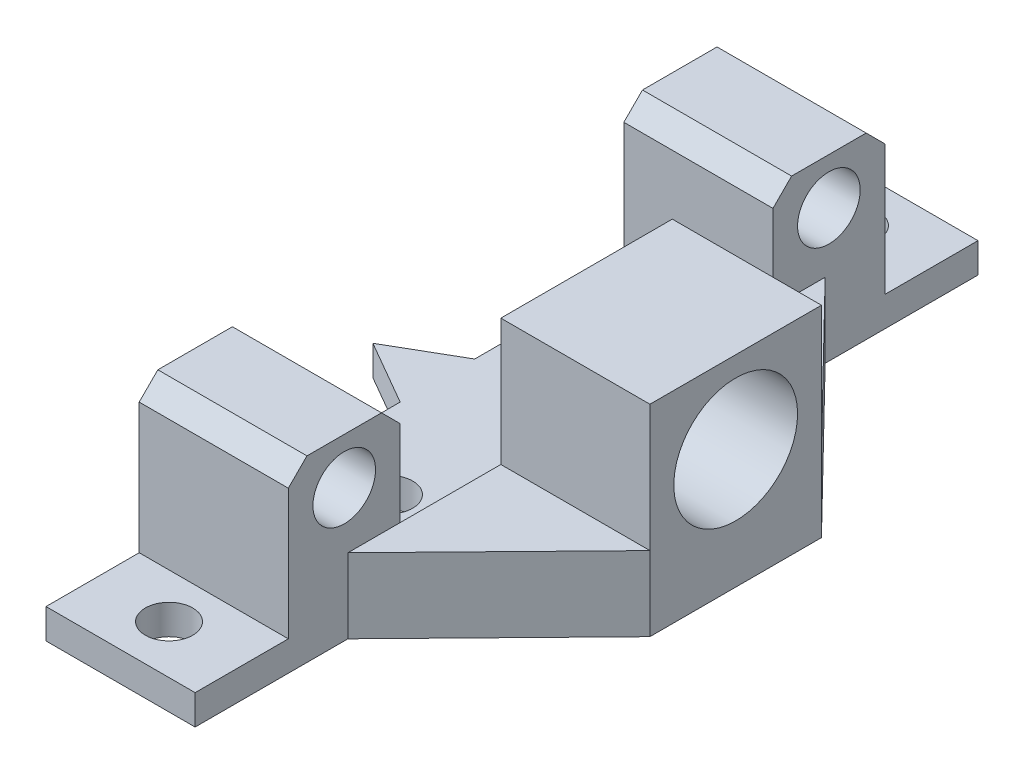
ISO-10303-21;
HEADER;
FILE_DESCRIPTION(('STEP AP214'),'2;1');
FILE_NAME('part.step','',(''),(''),'','','');
FILE_SCHEMA(('AUTOMOTIVE_DESIGN { 1 0 10303 214 1 1 1 1 }'));
ENDSEC;
DATA;
#1=APPLICATION_CONTEXT('core data for automotive mechanical design processes');
#2=APPLICATION_PROTOCOL_DEFINITION('international standard','automotive_design',2000,#1);
#3=PRODUCT_CONTEXT('',#1,'mechanical');
#4=PRODUCT('Part','Part','',(#3));
#5=PRODUCT_RELATED_PRODUCT_CATEGORY('part','',(#4));
#6=PRODUCT_DEFINITION_FORMATION('','',#4);
#7=PRODUCT_DEFINITION_CONTEXT('part definition',#1,'design');
#8=PRODUCT_DEFINITION('design','',#6,#7);
#9=PRODUCT_DEFINITION_SHAPE('','',#8);
#10=(LENGTH_UNIT() NAMED_UNIT(*) SI_UNIT(.MILLI.,.METRE.));
#11=(NAMED_UNIT(*) PLANE_ANGLE_UNIT() SI_UNIT($,.RADIAN.));
#12=(NAMED_UNIT(*) SI_UNIT($,.STERADIAN.) SOLID_ANGLE_UNIT());
#13=UNCERTAINTY_MEASURE_WITH_UNIT(LENGTH_MEASURE(1.E-05),#10,'distance_accuracy_value','');
#14=(GEOMETRIC_REPRESENTATION_CONTEXT(3) GLOBAL_UNCERTAINTY_ASSIGNED_CONTEXT((#13)) GLOBAL_UNIT_ASSIGNED_CONTEXT((#10,
#11,#12)) REPRESENTATION_CONTEXT('',''));
#15=CARTESIAN_POINT('',(0.,0.,0.));
#16=DIRECTION('',(0.,0.,1.));
#17=DIRECTION('',(1.,0.,0.));
#18=AXIS2_PLACEMENT_3D('',#15,#16,#17);
#19=CARTESIAN_POINT('',(40.,0.,-64.));
#20=DIRECTION('',(0.,0.,1.));
#21=DIRECTION('',(1.,0.,0.));
#22=AXIS2_PLACEMENT_3D('',#19,#20,#21);
#23=PLANE('',#22);
#24=DIRECTION('',(-1.,0.,0.));
#25=VECTOR('',#24,1.);
#26=CARTESIAN_POINT('',(40.,10.,-64.));
#27=LINE('',#26,#25);
#28=CARTESIAN_POINT('',(40.,10.,-64.));
#29=VERTEX_POINT('',#28);
#30=CARTESIAN_POINT('',(20.,10.,-64.));
#31=VERTEX_POINT('',#30);
#32=EDGE_CURVE('E250',#29,#31,#27,.T.);
#33=ORIENTED_EDGE('',*,*,#32,.T.);
#34=DIRECTION('',(0.,1.,0.));
#35=VECTOR('',#34,1.);
#36=CARTESIAN_POINT('',(20.,0.,-64.));
#37=LINE('',#36,#35);
#38=CARTESIAN_POINT('',(20.,27.,-64.));
#39=VERTEX_POINT('',#38);
#40=EDGE_CURVE('E289',#31,#39,#37,.T.);
#41=ORIENTED_EDGE('',*,*,#40,.T.);
#42=DIRECTION('',(-1.,0.,0.));
#43=VECTOR('',#42,1.);
#44=CARTESIAN_POINT('',(40.,27.,-64.));
#45=LINE('',#44,#43);
#46=CARTESIAN_POINT('',(40.,27.,-64.));
#47=VERTEX_POINT('',#46);
#48=EDGE_CURVE('E294',#47,#39,#45,.T.);
#49=ORIENTED_EDGE('',*,*,#48,.F.);
#50=DIRECTION('',(0.,1.,0.));
#51=VECTOR('',#50,1.);
#52=CARTESIAN_POINT('',(40.,0.,-64.));
#53=LINE('',#52,#51);
#54=EDGE_CURVE('E280',#29,#47,#53,.T.);
#55=ORIENTED_EDGE('',*,*,#54,.F.);
#56=EDGE_LOOP('',(#33,#41,#49,#55));
#57=FACE_BOUND('',#56,.T.);
#58=ADVANCED_FACE('F36',(#57),#23,.F.);
#59=CARTESIAN_POINT('',(20.,4.,0.));
#60=DIRECTION('',(-1.,0.,0.));
#61=DIRECTION('',(0.,0.,1.));
#62=AXIS2_PLACEMENT_3D('',#59,#60,#61);
#63=PLANE('',#62);
#64=CARTESIAN_POINT('',(20.,17.8,-20.));
#65=DIRECTION('',(-1.,0.,0.));
#66=DIRECTION('',(0.,0.,1.));
#67=AXIS2_PLACEMENT_3D('',#64,#65,#66);
#68=CIRCLE('',#67,4.2);
#69=CARTESIAN_POINT('',(20.,17.8,-15.8));
#70=VERTEX_POINT('',#69);
#71=EDGE_CURVE('E391',#70,#70,#68,.T.);
#72=ORIENTED_EDGE('',*,*,#71,.T.);
#73=EDGE_LOOP('',(#72));
#74=FACE_BOUND('',#73,.T.);
#75=DIRECTION('',(0.,0.,-1.));
#76=VECTOR('',#75,1.);
#77=CARTESIAN_POINT('',(20.,0.,0.));
#78=LINE('',#77,#76);
#79=CARTESIAN_POINT('',(20.,0.,0.));
#80=VERTEX_POINT('',#79);
#81=CARTESIAN_POINT('',(20.,0.,-20.5));
#82=VERTEX_POINT('',#81);
#83=EDGE_CURVE('E240',#80,#82,#78,.T.);
#84=ORIENTED_EDGE('',*,*,#83,.T.);
#85=DIRECTION('',(0.,-1.,0.));
#86=VECTOR('',#85,1.);
#87=CARTESIAN_POINT('',(20.,10.,-20.5));
#88=LINE('',#87,#86);
#89=CARTESIAN_POINT('',(20.,10.,-20.5));
#90=VERTEX_POINT('',#89);
#91=EDGE_CURVE('E230',#90,#82,#88,.T.);
#92=ORIENTED_EDGE('',*,*,#91,.F.);
#93=DIRECTION('',(0.,0.,-1.));
#94=VECTOR('',#93,1.);
#95=CARTESIAN_POINT('',(20.,10.,-41.));
#96=LINE('',#95,#94);
#97=CARTESIAN_POINT('',(20.,10.,-27.5));
#98=VERTEX_POINT('',#97);
#99=EDGE_CURVE('E216',#90,#98,#96,.T.);
#100=ORIENTED_EDGE('',*,*,#99,.T.);
#101=DIRECTION('',(0.,-1.,0.));
#102=VECTOR('',#101,1.);
#103=CARTESIAN_POINT('',(20.,0.,-27.5));
#104=LINE('',#103,#102);
#105=CARTESIAN_POINT('',(20.,21.5,-27.5));
#106=VERTEX_POINT('',#105);
#107=EDGE_CURVE('E412',#106,#98,#104,.T.);
#108=ORIENTED_EDGE('',*,*,#107,.F.);
#109=DIRECTION('',(0.,0.707106781186543,0.707106781186552));
#110=VECTOR('',#109,1.);
#111=CARTESIAN_POINT('',(20.,24.5000000000001,-24.4999999999998));
#112=LINE('',#111,#110);
#113=CARTESIAN_POINT('',(20.,24.,-25.));
#114=VERTEX_POINT('',#113);
#115=EDGE_CURVE('E422',#106,#114,#112,.T.);
#116=ORIENTED_EDGE('',*,*,#115,.T.);
#117=DIRECTION('',(0.,0.,1.));
#118=VECTOR('',#117,1.);
#119=CARTESIAN_POINT('',(20.,24.,0.));
#120=LINE('',#119,#118);
#121=CARTESIAN_POINT('',(20.,24.,-15.));
#122=VERTEX_POINT('',#121);
#123=EDGE_CURVE('E424',#114,#122,#120,.T.);
#124=ORIENTED_EDGE('',*,*,#123,.T.);
#125=DIRECTION('',(0.,-0.707106781186545,0.70710678118655));
#126=VECTOR('',#125,1.);
#127=CARTESIAN_POINT('',(20.,4.50000000000009,4.50000000000005));
#128=LINE('',#127,#126);
#129=CARTESIAN_POINT('',(20.,21.5,-12.5));
#130=VERTEX_POINT('',#129);
#131=EDGE_CURVE('E426',#122,#130,#128,.T.);
#132=ORIENTED_EDGE('',*,*,#131,.T.);
#133=DIRECTION('',(0.,-1.,0.));
#134=VECTOR('',#133,1.);
#135=CARTESIAN_POINT('',(20.,0.,-12.5));
#136=LINE('',#135,#134);
#137=CARTESIAN_POINT('',(20.,4.,-12.5));
#138=VERTEX_POINT('',#137);
#139=EDGE_CURVE('E428',#130,#138,#136,.T.);
#140=ORIENTED_EDGE('',*,*,#139,.T.);
#141=DIRECTION('',(0.,0.,-1.));
#142=VECTOR('',#141,1.);
#143=CARTESIAN_POINT('',(20.,4.,0.));
#144=LINE('',#143,#142);
#145=CARTESIAN_POINT('',(20.,4.,0.));
#146=VERTEX_POINT('',#145);
#147=EDGE_CURVE('E440',#146,#138,#144,.T.);
#148=ORIENTED_EDGE('',*,*,#147,.F.);
#149=DIRECTION('',(0.,-1.,0.));
#150=VECTOR('',#149,1.);
#151=CARTESIAN_POINT('',(20.,4.,0.));
#152=LINE('',#151,#150);
#153=EDGE_CURVE('E44',#146,#80,#152,.T.);
#154=ORIENTED_EDGE('',*,*,#153,.T.);
#155=EDGE_LOOP('',(#84,#92,#100,#108,#116,#124,#132,#140,#148,#154));
#156=FACE_BOUND('',#155,.T.);
#157=ADVANCED_FACE('F237',(#74,#156),#63,.F.);
#158=CARTESIAN_POINT('',(20.,17.8,-85.));
#159=DIRECTION('',(-1.,0.,0.));
#160=DIRECTION('',(0.,0.,1.));
#161=AXIS2_PLACEMENT_3D('',#158,#159,#160);
#162=CIRCLE('',#161,4.19999999999999);
#163=CARTESIAN_POINT('',(20.,17.8,-80.8));
#164=VERTEX_POINT('',#163);
#165=EDGE_CURVE('E352',#164,#164,#162,.F.);
#166=ORIENTED_EDGE('',*,*,#165,.F.);
#167=EDGE_LOOP('',(#166));
#168=FACE_BOUND('',#167,.T.);
#169=DIRECTION('',(0.,0.,-1.));
#170=VECTOR('',#169,1.);
#171=CARTESIAN_POINT('',(20.,10.,-64.));
#172=LINE('',#171,#170);
#173=CARTESIAN_POINT('',(20.,10.,-77.5));
#174=VERTEX_POINT('',#173);
#175=CARTESIAN_POINT('',(20.,10.,-84.5));
#176=VERTEX_POINT('',#175);
#177=EDGE_CURVE('E253',#174,#176,#172,.T.);
#178=ORIENTED_EDGE('',*,*,#177,.T.);
#179=DIRECTION('',(0.,-1.,0.));
#180=VECTOR('',#179,1.);
#181=CARTESIAN_POINT('',(20.,10.,-84.5));
#182=LINE('',#181,#180);
#183=CARTESIAN_POINT('',(20.,0.,-84.5));
#184=VERTEX_POINT('',#183);
#185=EDGE_CURVE('E258',#176,#184,#182,.T.);
#186=ORIENTED_EDGE('',*,*,#185,.T.);
#187=CARTESIAN_POINT('',(20.,0.,-105.));
#188=VERTEX_POINT('',#187);
#189=EDGE_CURVE('E451',#184,#188,#78,.T.);
#190=ORIENTED_EDGE('',*,*,#189,.T.);
#191=DIRECTION('',(0.,-1.,0.));
#192=VECTOR('',#191,1.);
#193=CARTESIAN_POINT('',(20.,4.,-105.));
#194=LINE('',#193,#192);
#195=CARTESIAN_POINT('',(20.,4.,-105.));
#196=VERTEX_POINT('',#195);
#197=EDGE_CURVE('E457',#196,#188,#194,.T.);
#198=ORIENTED_EDGE('',*,*,#197,.F.);
#199=CARTESIAN_POINT('',(20.,4.,-92.5));
#200=VERTEX_POINT('',#199);
#201=EDGE_CURVE('E439',#200,#196,#144,.T.);
#202=ORIENTED_EDGE('',*,*,#201,.F.);
#203=DIRECTION('',(0.,-1.,0.));
#204=VECTOR('',#203,1.);
#205=CARTESIAN_POINT('',(20.,0.,-92.5));
#206=LINE('',#205,#204);
#207=CARTESIAN_POINT('',(20.,21.5,-92.5));
#208=VERTEX_POINT('',#207);
#209=EDGE_CURVE('E343',#208,#200,#206,.T.);
#210=ORIENTED_EDGE('',*,*,#209,.F.);
#211=DIRECTION('',(0.,-0.707106781186545,-0.70710678118655));
#212=VECTOR('',#211,1.);
#213=CARTESIAN_POINT('',(20.,57.0000000000001,-56.9999999999997));
#214=LINE('',#213,#212);
#215=CARTESIAN_POINT('',(20.,24.,-90.));
#216=VERTEX_POINT('',#215);
#217=EDGE_CURVE('E349',#216,#208,#214,.T.);
#218=ORIENTED_EDGE('',*,*,#217,.F.);
#219=DIRECTION('',(0.,0.,-1.));
#220=VECTOR('',#219,1.);
#221=CARTESIAN_POINT('',(20.,24.,0.));
#222=LINE('',#221,#220);
#223=CARTESIAN_POINT('',(20.,24.,-80.));
#224=VERTEX_POINT('',#223);
#225=EDGE_CURVE('E346',#224,#216,#222,.T.);
#226=ORIENTED_EDGE('',*,*,#225,.F.);
#227=DIRECTION('',(0.,0.707106781186543,-0.707106781186552));
#228=VECTOR('',#227,1.);
#229=CARTESIAN_POINT('',(20.,-27.9999999999999,-27.9999999999995));
#230=LINE('',#229,#228);
#231=CARTESIAN_POINT('',(20.,21.5,-77.5));
#232=VERTEX_POINT('',#231);
#233=EDGE_CURVE('E342',#232,#224,#230,.T.);
#234=ORIENTED_EDGE('',*,*,#233,.F.);
#235=DIRECTION('',(0.,-1.,0.));
#236=VECTOR('',#235,1.);
#237=CARTESIAN_POINT('',(20.,0.,-77.5));
#238=LINE('',#237,#236);
#239=EDGE_CURVE('E339',#232,#174,#238,.T.);
#240=ORIENTED_EDGE('',*,*,#239,.T.);
#241=EDGE_LOOP('',(#178,#186,#190,#198,#202,#210,#218,#226,#234,#240));
#242=FACE_BOUND('',#241,.T.);
#243=ADVANCED_FACE('F520',(#168,#242),#63,.F.);
#244=CARTESIAN_POINT('',(0.,4.,0.));
#245=DIRECTION('',(1.,0.,0.));
#246=DIRECTION('',(0.,0.,-1.));
#247=AXIS2_PLACEMENT_3D('',#244,#245,#246);
#248=PLANE('',#247);
#249=CARTESIAN_POINT('',(0.,17.8,-85.));
#250=DIRECTION('',(-1.,0.,0.));
#251=DIRECTION('',(0.,0.,1.));
#252=AXIS2_PLACEMENT_3D('',#249,#250,#251);
#253=CIRCLE('',#252,4.19999999999999);
#254=CARTESIAN_POINT('',(0.,17.8,-80.8));
#255=VERTEX_POINT('',#254);
#256=EDGE_CURVE('E338',#255,#255,#253,.T.);
#257=ORIENTED_EDGE('',*,*,#256,.F.);
#258=EDGE_LOOP('',(#257));
#259=FACE_BOUND('',#258,.T.);
#260=DIRECTION('',(0.,-1.,0.));
#261=VECTOR('',#260,1.);
#262=CARTESIAN_POINT('',(0.,17.228756555323,-57.5));
#263=LINE('',#262,#261);
#264=CARTESIAN_POINT('',(0.,4.,-57.5));
#265=VERTEX_POINT('',#264);
#266=CARTESIAN_POINT('',(0.,0.,-57.5));
#267=VERTEX_POINT('',#266);
#268=EDGE_CURVE('E325',#265,#267,#263,.T.);
#269=ORIENTED_EDGE('',*,*,#268,.F.);
#270=DIRECTION('',(0.,0.,1.));
#271=VECTOR('',#270,1.);
#272=CARTESIAN_POINT('',(0.,4.,0.));
#273=LINE('',#272,#271);
#274=CARTESIAN_POINT('',(0.,4.,-77.5));
#275=VERTEX_POINT('',#274);
#276=EDGE_CURVE('E436',#275,#265,#273,.T.);
#277=ORIENTED_EDGE('',*,*,#276,.F.);
#278=DIRECTION('',(0.,1.,0.));
#279=VECTOR('',#278,1.);
#280=CARTESIAN_POINT('',(0.,0.,-77.5));
#281=LINE('',#280,#279);
#282=CARTESIAN_POINT('',(0.,21.5,-77.5));
#283=VERTEX_POINT('',#282);
#284=EDGE_CURVE('E364',#275,#283,#281,.T.);
#285=ORIENTED_EDGE('',*,*,#284,.T.);
#286=DIRECTION('',(0.,-0.707106781186543,0.707106781186552));
#287=VECTOR('',#286,1.);
#288=CARTESIAN_POINT('',(0.,-27.9999999999999,-27.9999999999995));
#289=LINE('',#288,#287);
#290=CARTESIAN_POINT('',(0.,24.,-80.));
#291=VERTEX_POINT('',#290);
#292=EDGE_CURVE('E367',#291,#283,#289,.T.);
#293=ORIENTED_EDGE('',*,*,#292,.F.);
#294=DIRECTION('',(0.,0.,1.));
#295=VECTOR('',#294,1.);
#296=CARTESIAN_POINT('',(0.,24.,0.));
#297=LINE('',#296,#295);
#298=CARTESIAN_POINT('',(0.,24.,-90.));
#299=VERTEX_POINT('',#298);
#300=EDGE_CURVE('E370',#299,#291,#297,.T.);
#301=ORIENTED_EDGE('',*,*,#300,.F.);
#302=DIRECTION('',(0.,0.707106781186545,0.70710678118655));
#303=VECTOR('',#302,1.);
#304=CARTESIAN_POINT('',(0.,57.0000000000001,-56.9999999999997));
#305=LINE('',#304,#303);
#306=CARTESIAN_POINT('',(0.,21.5,-92.5));
#307=VERTEX_POINT('',#306);
#308=EDGE_CURVE('E358',#307,#299,#305,.T.);
#309=ORIENTED_EDGE('',*,*,#308,.F.);
#310=DIRECTION('',(0.,1.,0.));
#311=VECTOR('',#310,1.);
#312=CARTESIAN_POINT('',(0.,0.,-92.5));
#313=LINE('',#312,#311);
#314=CARTESIAN_POINT('',(0.,4.,-92.5));
#315=VERTEX_POINT('',#314);
#316=EDGE_CURVE('E361',#315,#307,#313,.T.);
#317=ORIENTED_EDGE('',*,*,#316,.F.);
#318=CARTESIAN_POINT('',(0.,4.,-105.));
#319=VERTEX_POINT('',#318);
#320=EDGE_CURVE('E433',#319,#315,#273,.T.);
#321=ORIENTED_EDGE('',*,*,#320,.F.);
#322=DIRECTION('',(0.,-1.,0.));
#323=VECTOR('',#322,1.);
#324=CARTESIAN_POINT('',(0.,4.,-105.));
#325=LINE('',#324,#323);
#326=CARTESIAN_POINT('',(0.,0.,-105.));
#327=VERTEX_POINT('',#326);
#328=EDGE_CURVE('E446',#319,#327,#325,.T.);
#329=ORIENTED_EDGE('',*,*,#328,.T.);
#330=DIRECTION('',(0.,0.,1.));
#331=VECTOR('',#330,1.);
#332=CARTESIAN_POINT('',(0.,0.,0.));
#333=LINE('',#332,#331);
#334=EDGE_CURVE('E447',#327,#267,#333,.T.);
#335=ORIENTED_EDGE('',*,*,#334,.T.);
#336=EDGE_LOOP('',(#269,#277,#285,#293,#301,#309,#317,#321,#329,#335));
#337=FACE_BOUND('',#336,.T.);
#338=ADVANCED_FACE('F509',(#259,#337),#248,.F.);
#339=CARTESIAN_POINT('',(0.,4.,0.));
#340=DIRECTION('',(0.,-1.,0.));
#341=DIRECTION('',(0.,0.,-1.));
#342=AXIS2_PLACEMENT_3D('',#339,#340,#341);
#343=PLANE('',#342);
#344=CARTESIAN_POINT('',(9.99999999999999,4.,-98.5));
#345=DIRECTION('',(0.,1.,0.));
#346=DIRECTION('',(0.,0.,1.));
#347=AXIS2_PLACEMENT_3D('',#344,#345,#346);
#348=CIRCLE('',#347,3.175);
#349=CARTESIAN_POINT('',(9.99999999999999,4.,-95.325));
#350=VERTEX_POINT('',#349);
#351=EDGE_CURVE('E302',#350,#350,#348,.T.);
#352=ORIENTED_EDGE('',*,*,#351,.F.);
#353=EDGE_LOOP('',(#352));
#354=FACE_BOUND('',#353,.T.);
#355=DIRECTION('',(-1.,0.,0.));
#356=VECTOR('',#355,1.);
#357=CARTESIAN_POINT('',(45.,4.,-92.5));
#358=LINE('',#357,#356);
#359=EDGE_CURVE('E382',#200,#315,#358,.T.);
#360=ORIENTED_EDGE('',*,*,#359,.F.);
#361=ORIENTED_EDGE('',*,*,#201,.T.);
#362=DIRECTION('',(-1.,0.,0.));
#363=VECTOR('',#362,1.);
#364=CARTESIAN_POINT('',(0.,4.,-105.));
#365=LINE('',#364,#363);
#366=EDGE_CURVE('E443',#196,#319,#365,.T.);
#367=ORIENTED_EDGE('',*,*,#366,.T.);
#368=ORIENTED_EDGE('',*,*,#320,.T.);
#369=EDGE_LOOP('',(#360,#361,#367,#368));
#370=FACE_BOUND('',#369,.T.);
#371=ADVANCED_FACE('F616',(#354,#370),#343,.F.);
#372=CARTESIAN_POINT('',(9.99999999999999,4.,-69.));
#373=DIRECTION('',(0.,1.,0.));
#374=DIRECTION('',(0.,0.,1.));
#375=AXIS2_PLACEMENT_3D('',#372,#373,#374);
#376=CIRCLE('',#375,3.175);
#377=CARTESIAN_POINT('',(9.99999999999999,4.,-65.825));
#378=VERTEX_POINT('',#377);
#379=EDGE_CURVE('E308',#378,#378,#376,.T.);
#380=ORIENTED_EDGE('',*,*,#379,.F.);
#381=EDGE_LOOP('',(#380));
#382=FACE_BOUND('',#381,.T.);
#383=CARTESIAN_POINT('',(10.,4.,-36.));
#384=DIRECTION('',(0.,1.,0.));
#385=DIRECTION('',(0.,0.,1.));
#386=AXIS2_PLACEMENT_3D('',#383,#384,#385);
#387=CIRCLE('',#386,3.175);
#388=CARTESIAN_POINT('',(10.,4.,-32.825));
#389=VERTEX_POINT('',#388);
#390=EDGE_CURVE('E314',#389,#389,#387,.T.);
#391=ORIENTED_EDGE('',*,*,#390,.F.);
#392=EDGE_LOOP('',(#391));
#393=FACE_BOUND('',#392,.T.);
#394=CARTESIAN_POINT('',(20.,4.,-27.5));
#395=VERTEX_POINT('',#394);
#396=CARTESIAN_POINT('',(20.,4.,-77.5));
#397=VERTEX_POINT('',#396);
#398=EDGE_CURVE('E444',#395,#397,#144,.T.);
#399=ORIENTED_EDGE('',*,*,#398,.T.);
#400=DIRECTION('',(-1.,0.,0.));
#401=VECTOR('',#400,1.);
#402=CARTESIAN_POINT('',(45.,4.,-77.5));
#403=LINE('',#402,#401);
#404=EDGE_CURVE('E380',#397,#275,#403,.T.);
#405=ORIENTED_EDGE('',*,*,#404,.T.);
#406=ORIENTED_EDGE('',*,*,#276,.T.);
#407=DIRECTION('',(-0.866025403784438,0.,0.5));
#408=VECTOR('',#407,1.);
#409=CARTESIAN_POINT('',(0.,4.,-57.5));
#410=LINE('',#409,#408);
#411=CARTESIAN_POINT('',(-8.66025403784439,4.,-52.5));
#412=VERTEX_POINT('',#411);
#413=EDGE_CURVE('E322',#265,#412,#410,.T.);
#414=ORIENTED_EDGE('',*,*,#413,.T.);
#415=DIRECTION('',(0.866025403784439,0.,0.5));
#416=VECTOR('',#415,1.);
#417=CARTESIAN_POINT('',(-8.66025403784439,4.,-52.5));
#418=LINE('',#417,#416);
#419=CARTESIAN_POINT('',(0.,4.,-47.5));
#420=VERTEX_POINT('',#419);
#421=EDGE_CURVE('E324',#412,#420,#418,.T.);
#422=ORIENTED_EDGE('',*,*,#421,.T.);
#423=CARTESIAN_POINT('',(0.,4.,-27.5));
#424=VERTEX_POINT('',#423);
#425=EDGE_CURVE('E59',#420,#424,#273,.T.);
#426=ORIENTED_EDGE('',*,*,#425,.T.);
#427=DIRECTION('',(-1.,0.,0.));
#428=VECTOR('',#427,1.);
#429=CARTESIAN_POINT('',(45.,4.,-27.5));
#430=LINE('',#429,#428);
#431=EDGE_CURVE('E397',#395,#424,#430,.T.);
#432=ORIENTED_EDGE('',*,*,#431,.F.);
#433=EDGE_LOOP('',(#399,#405,#406,#414,#422,#426,#432));
#434=FACE_BOUND('',#433,.T.);
#435=ADVANCED_FACE('F487',(#382,#393,#434),#343,.F.);
#436=ORIENTED_EDGE('',*,*,#425,.F.);
#437=DIRECTION('',(0.,-1.,0.));
#438=VECTOR('',#437,1.);
#439=CARTESIAN_POINT('',(0.,17.228756555323,-47.5));
#440=LINE('',#439,#438);
#441=CARTESIAN_POINT('',(0.,0.,-47.5));
#442=VERTEX_POINT('',#441);
#443=EDGE_CURVE('E331',#420,#442,#440,.T.);
#444=ORIENTED_EDGE('',*,*,#443,.T.);
#445=CARTESIAN_POINT('',(0.,0.,0.));
#446=VERTEX_POINT('',#445);
#447=EDGE_CURVE('E430',#442,#446,#333,.T.);
#448=ORIENTED_EDGE('',*,*,#447,.T.);
#449=DIRECTION('',(0.,-1.,0.));
#450=VECTOR('',#449,1.);
#451=CARTESIAN_POINT('',(0.,4.,0.));
#452=LINE('',#451,#450);
#453=CARTESIAN_POINT('',(0.,4.,0.));
#454=VERTEX_POINT('',#453);
#455=EDGE_CURVE('E11',#454,#446,#452,.T.);
#456=ORIENTED_EDGE('',*,*,#455,.F.);
#457=CARTESIAN_POINT('',(0.,4.,-12.5));
#458=VERTEX_POINT('',#457);
#459=EDGE_CURVE('E437',#458,#454,#273,.T.);
#460=ORIENTED_EDGE('',*,*,#459,.F.);
#461=DIRECTION('',(0.,1.,0.));
#462=VECTOR('',#461,1.);
#463=CARTESIAN_POINT('',(0.,0.,-12.5));
#464=LINE('',#463,#462);
#465=CARTESIAN_POINT('',(0.,21.5,-12.5));
#466=VERTEX_POINT('',#465);
#467=EDGE_CURVE('E406',#458,#466,#464,.T.);
#468=ORIENTED_EDGE('',*,*,#467,.T.);
#469=DIRECTION('',(0.,0.707106781186545,-0.70710678118655));
#470=VECTOR('',#469,1.);
#471=CARTESIAN_POINT('',(0.,4.50000000000009,4.50000000000005));
#472=LINE('',#471,#470);
#473=CARTESIAN_POINT('',(0.,24.,-15.));
#474=VERTEX_POINT('',#473);
#475=EDGE_CURVE('E403',#466,#474,#472,.T.);
#476=ORIENTED_EDGE('',*,*,#475,.T.);
#477=DIRECTION('',(0.,0.,-1.));
#478=VECTOR('',#477,1.);
#479=CARTESIAN_POINT('',(0.,24.,0.));
#480=LINE('',#479,#478);
#481=CARTESIAN_POINT('',(0.,24.,-25.));
#482=VERTEX_POINT('',#481);
#483=EDGE_CURVE('E400',#474,#482,#480,.T.);
#484=ORIENTED_EDGE('',*,*,#483,.T.);
#485=DIRECTION('',(0.,-0.707106781186543,-0.707106781186552));
#486=VECTOR('',#485,1.);
#487=CARTESIAN_POINT('',(0.,24.5000000000001,-24.4999999999998));
#488=LINE('',#487,#486);
#489=CARTESIAN_POINT('',(0.,21.5,-27.5));
#490=VERTEX_POINT('',#489);
#491=EDGE_CURVE('E392',#482,#490,#488,.T.);
#492=ORIENTED_EDGE('',*,*,#491,.T.);
#493=DIRECTION('',(0.,1.,0.));
#494=VECTOR('',#493,1.);
#495=CARTESIAN_POINT('',(0.,0.,-27.5));
#496=LINE('',#495,#494);
#497=EDGE_CURVE('E393',#424,#490,#496,.T.);
#498=ORIENTED_EDGE('',*,*,#497,.F.);
#499=EDGE_LOOP('',(#436,#444,#448,#456,#460,#468,#476,#484,#492,#498));
#500=FACE_BOUND('',#499,.T.);
#501=CARTESIAN_POINT('',(0.,17.8,-20.));
#502=DIRECTION('',(-1.,0.,0.));
#503=DIRECTION('',(0.,0.,1.));
#504=AXIS2_PLACEMENT_3D('',#501,#502,#503);
#505=CIRCLE('',#504,4.2);
#506=CARTESIAN_POINT('',(0.,17.8,-15.8));
#507=VERTEX_POINT('',#506);
#508=EDGE_CURVE('E388',#507,#507,#505,.F.);
#509=ORIENTED_EDGE('',*,*,#508,.T.);
#510=EDGE_LOOP('',(#509));
#511=FACE_BOUND('',#510,.T.);
#512=ADVANCED_FACE('F38',(#500,#511),#248,.F.);
#513=CARTESIAN_POINT('',(0.,4.,0.));
#514=DIRECTION('',(0.,0.,-1.));
#515=DIRECTION('',(-1.,0.,0.));
#516=AXIS2_PLACEMENT_3D('',#513,#514,#515);
#517=PLANE('',#516);
#518=DIRECTION('',(1.,0.,0.));
#519=VECTOR('',#518,1.);
#520=CARTESIAN_POINT('',(0.,0.,0.));
#521=LINE('',#520,#519);
#522=EDGE_CURVE('E449',#446,#80,#521,.T.);
#523=ORIENTED_EDGE('',*,*,#522,.T.);
#524=ORIENTED_EDGE('',*,*,#153,.F.);
#525=DIRECTION('',(1.,0.,0.));
#526=VECTOR('',#525,1.);
#527=CARTESIAN_POINT('',(0.,4.,0.));
#528=LINE('',#527,#526);
#529=EDGE_CURVE('E435',#454,#146,#528,.T.);
#530=ORIENTED_EDGE('',*,*,#529,.F.);
#531=ORIENTED_EDGE('',*,*,#455,.T.);
#532=EDGE_LOOP('',(#523,#524,#530,#531));
#533=FACE_BOUND('',#532,.T.);
#534=ADVANCED_FACE('F496',(#533),#517,.F.);
#535=CARTESIAN_POINT('',(0.,4.,-105.));
#536=DIRECTION('',(0.,0.,1.));
#537=DIRECTION('',(1.,0.,0.));
#538=AXIS2_PLACEMENT_3D('',#535,#536,#537);
#539=PLANE('',#538);
#540=DIRECTION('',(-1.,0.,0.));
#541=VECTOR('',#540,1.);
#542=CARTESIAN_POINT('',(0.,0.,-105.));
#543=LINE('',#542,#541);
#544=EDGE_CURVE('E453',#188,#327,#543,.T.);
#545=ORIENTED_EDGE('',*,*,#544,.T.);
#546=ORIENTED_EDGE('',*,*,#328,.F.);
#547=ORIENTED_EDGE('',*,*,#366,.F.);
#548=ORIENTED_EDGE('',*,*,#197,.T.);
#549=EDGE_LOOP('',(#545,#546,#547,#548));
#550=FACE_BOUND('',#549,.T.);
#551=ADVANCED_FACE('F516',(#550),#539,.F.);
#552=CARTESIAN_POINT('',(10.,4.,-6.5));
#553=DIRECTION('',(0.,1.,0.));
#554=DIRECTION('',(0.,0.,1.));
#555=AXIS2_PLACEMENT_3D('',#552,#553,#554);
#556=CIRCLE('',#555,3.175);
#557=CARTESIAN_POINT('',(10.,4.,-3.325));
#558=VERTEX_POINT('',#557);
#559=EDGE_CURVE('E297',#558,#558,#556,.T.);
#560=ORIENTED_EDGE('',*,*,#559,.F.);
#561=EDGE_LOOP('',(#560));
#562=FACE_BOUND('',#561,.T.);
#563=ORIENTED_EDGE('',*,*,#147,.T.);
#564=DIRECTION('',(-1.,0.,0.));
#565=VECTOR('',#564,1.);
#566=CARTESIAN_POINT('',(45.,4.,-12.5));
#567=LINE('',#566,#565);
#568=EDGE_CURVE('E355',#138,#458,#567,.T.);
#569=ORIENTED_EDGE('',*,*,#568,.T.);
#570=ORIENTED_EDGE('',*,*,#459,.T.);
#571=ORIENTED_EDGE('',*,*,#529,.T.);
#572=EDGE_LOOP('',(#563,#569,#570,#571));
#573=FACE_BOUND('',#572,.T.);
#574=ADVANCED_FACE('F493',(#562,#573),#343,.F.);
#575=CARTESIAN_POINT('',(0.,0.,0.));
#576=DIRECTION('',(0.,-1.,0.));
#577=DIRECTION('',(0.,0.,-1.));
#578=AXIS2_PLACEMENT_3D('',#575,#576,#577);
#579=PLANE('',#578);
#580=ORIENTED_EDGE('',*,*,#189,.F.);
#581=DIRECTION('',(0.698323852075328,0.,0.715781948377211));
#582=VECTOR('',#581,1.);
#583=CARTESIAN_POINT('',(40.,0.,-64.));
#584=LINE('',#583,#582);
#585=CARTESIAN_POINT('',(40.,0.,-64.));
#586=VERTEX_POINT('',#585);
#587=EDGE_CURVE('E249',#184,#586,#584,.T.);
#588=ORIENTED_EDGE('',*,*,#587,.T.);
#589=DIRECTION('',(0.,0.,-1.));
#590=VECTOR('',#589,1.);
#591=CARTESIAN_POINT('',(40.,0.,-41.));
#592=LINE('',#591,#590);
#593=CARTESIAN_POINT('',(40.,0.,-41.));
#594=VERTEX_POINT('',#593);
#595=EDGE_CURVE('E276',#594,#586,#592,.T.);
#596=ORIENTED_EDGE('',*,*,#595,.F.);
#597=DIRECTION('',(-0.698323852075328,0.,0.715781948377211));
#598=VECTOR('',#597,1.);
#599=CARTESIAN_POINT('',(20.,0.,-20.5));
#600=LINE('',#599,#598);
#601=EDGE_CURVE('E234',#594,#82,#600,.T.);
#602=ORIENTED_EDGE('',*,*,#601,.T.);
#603=ORIENTED_EDGE('',*,*,#83,.F.);
#604=ORIENTED_EDGE('',*,*,#522,.F.);
#605=ORIENTED_EDGE('',*,*,#447,.F.);
#606=DIRECTION('',(-0.866025403784439,0.,-0.5));
#607=VECTOR('',#606,1.);
#608=CARTESIAN_POINT('',(-8.66025403784439,0.,-52.5));
#609=LINE('',#608,#607);
#610=CARTESIAN_POINT('',(-8.66025403784439,0.,-52.5));
#611=VERTEX_POINT('',#610);
#612=EDGE_CURVE('E301',#442,#611,#609,.T.);
#613=ORIENTED_EDGE('',*,*,#612,.T.);
#614=DIRECTION('',(0.866025403784438,0.,-0.5));
#615=VECTOR('',#614,1.);
#616=CARTESIAN_POINT('',(0.,0.,-57.5));
#617=LINE('',#616,#615);
#618=EDGE_CURVE('E328',#611,#267,#617,.T.);
#619=ORIENTED_EDGE('',*,*,#618,.T.);
#620=ORIENTED_EDGE('',*,*,#334,.F.);
#621=ORIENTED_EDGE('',*,*,#544,.F.);
#622=EDGE_LOOP('',(#580,#588,#596,#602,#603,#604,#605,#613,#619,#620,#621));
#623=FACE_BOUND('',#622,.T.);
#624=CARTESIAN_POINT('',(9.99999999999999,0.,-98.5));
#625=DIRECTION('',(0.,1.,0.));
#626=DIRECTION('',(0.,0.,1.));
#627=AXIS2_PLACEMENT_3D('',#624,#625,#626);
#628=CIRCLE('',#627,3.175);
#629=CARTESIAN_POINT('',(9.99999999999999,0.,-95.325));
#630=VERTEX_POINT('',#629);
#631=EDGE_CURVE('E298',#630,#630,#628,.T.);
#632=ORIENTED_EDGE('',*,*,#631,.T.);
#633=EDGE_LOOP('',(#632));
#634=FACE_BOUND('',#633,.T.);
#635=CARTESIAN_POINT('',(9.99999999999999,0.,-69.));
#636=DIRECTION('',(0.,1.,0.));
#637=DIRECTION('',(0.,0.,1.));
#638=AXIS2_PLACEMENT_3D('',#635,#636,#637);
#639=CIRCLE('',#638,3.175);
#640=CARTESIAN_POINT('',(9.99999999999999,0.,-65.825));
#641=VERTEX_POINT('',#640);
#642=EDGE_CURVE('E305',#641,#641,#639,.T.);
#643=ORIENTED_EDGE('',*,*,#642,.T.);
#644=EDGE_LOOP('',(#643));
#645=FACE_BOUND('',#644,.T.);
#646=CARTESIAN_POINT('',(10.,0.,-36.));
#647=DIRECTION('',(0.,1.,0.));
#648=DIRECTION('',(0.,0.,1.));
#649=AXIS2_PLACEMENT_3D('',#646,#647,#648);
#650=CIRCLE('',#649,3.175);
#651=CARTESIAN_POINT('',(10.,0.,-32.825));
#652=VERTEX_POINT('',#651);
#653=EDGE_CURVE('E311',#652,#652,#650,.T.);
#654=ORIENTED_EDGE('',*,*,#653,.T.);
#655=EDGE_LOOP('',(#654));
#656=FACE_BOUND('',#655,.T.);
#657=CARTESIAN_POINT('',(10.,0.,-6.5));
#658=DIRECTION('',(0.,1.,0.));
#659=DIRECTION('',(0.,0.,1.));
#660=AXIS2_PLACEMENT_3D('',#657,#658,#659);
#661=CIRCLE('',#660,3.175);
#662=CARTESIAN_POINT('',(10.,0.,-3.325));
#663=VERTEX_POINT('',#662);
#664=EDGE_CURVE('E317',#663,#663,#661,.T.);
#665=ORIENTED_EDGE('',*,*,#664,.T.);
#666=EDGE_LOOP('',(#665));
#667=FACE_BOUND('',#666,.T.);
#668=ADVANCED_FACE('F466',(#623,#634,#645,#656,#667),#579,.T.);
#669=CARTESIAN_POINT('',(45.,0.,-27.5));
#670=DIRECTION('',(0.,0.,1.));
#671=DIRECTION('',(0.,-1.,0.));
#672=AXIS2_PLACEMENT_3D('',#669,#670,#671);
#673=PLANE('',#672);
#674=DIRECTION('',(-1.,0.,0.));
#675=VECTOR('',#674,1.);
#676=CARTESIAN_POINT('',(45.,21.5,-27.5));
#677=LINE('',#676,#675);
#678=EDGE_CURVE('E396',#106,#490,#677,.T.);
#679=ORIENTED_EDGE('',*,*,#678,.F.);
#680=ORIENTED_EDGE('',*,*,#107,.T.);
#681=DIRECTION('',(0.,-1.,0.));
#682=VECTOR('',#681,1.);
#683=CARTESIAN_POINT('',(20.,0.,-27.5));
#684=LINE('',#683,#682);
#685=EDGE_CURVE('E242',#98,#395,#684,.T.);
#686=ORIENTED_EDGE('',*,*,#685,.T.);
#687=ORIENTED_EDGE('',*,*,#431,.T.);
#688=ORIENTED_EDGE('',*,*,#497,.T.);
#689=EDGE_LOOP('',(#679,#680,#686,#687,#688));
#690=FACE_BOUND('',#689,.T.);
#691=ADVANCED_FACE('F485',(#690),#673,.F.);
#692=CARTESIAN_POINT('',(45.,24.5000000000001,-24.4999999999998));
#693=DIRECTION('',(0.,0.707106781186552,-0.707106781186543));
#694=DIRECTION('',(0.,0.707106781186543,0.707106781186552));
#695=AXIS2_PLACEMENT_3D('',#692,#693,#694);
#696=PLANE('',#695);
#697=ORIENTED_EDGE('',*,*,#115,.F.);
#698=ORIENTED_EDGE('',*,*,#678,.T.);
#699=ORIENTED_EDGE('',*,*,#491,.F.);
#700=DIRECTION('',(-1.,0.,0.));
#701=VECTOR('',#700,1.);
#702=CARTESIAN_POINT('',(45.,24.,-25.));
#703=LINE('',#702,#701);
#704=EDGE_CURVE('E414',#114,#482,#703,.T.);
#705=ORIENTED_EDGE('',*,*,#704,.F.);
#706=EDGE_LOOP('',(#697,#698,#699,#705));
#707=FACE_BOUND('',#706,.T.);
#708=ADVANCED_FACE('F603',(#707),#696,.T.);
#709=CARTESIAN_POINT('',(45.,24.,0.));
#710=DIRECTION('',(0.,1.,0.));
#711=DIRECTION('',(0.,0.,1.));
#712=AXIS2_PLACEMENT_3D('',#709,#710,#711);
#713=PLANE('',#712);
#714=ORIENTED_EDGE('',*,*,#123,.F.);
#715=ORIENTED_EDGE('',*,*,#704,.T.);
#716=ORIENTED_EDGE('',*,*,#483,.F.);
#717=DIRECTION('',(-1.,0.,0.));
#718=VECTOR('',#717,1.);
#719=CARTESIAN_POINT('',(45.,24.,-15.));
#720=LINE('',#719,#718);
#721=EDGE_CURVE('E416',#122,#474,#720,.T.);
#722=ORIENTED_EDGE('',*,*,#721,.F.);
#723=EDGE_LOOP('',(#714,#715,#716,#722));
#724=FACE_BOUND('',#723,.T.);
#725=ADVANCED_FACE('F599',(#724),#713,.T.);
#726=CARTESIAN_POINT('',(45.,4.50000000000009,4.50000000000005));
#727=DIRECTION('',(0.,0.70710678118655,0.707106781186545));
#728=DIRECTION('',(0.,-0.707106781186545,0.70710678118655));
#729=AXIS2_PLACEMENT_3D('',#726,#727,#728);
#730=PLANE('',#729);
#731=ORIENTED_EDGE('',*,*,#131,.F.);
#732=ORIENTED_EDGE('',*,*,#721,.T.);
#733=ORIENTED_EDGE('',*,*,#475,.F.);
#734=DIRECTION('',(-1.,0.,0.));
#735=VECTOR('',#734,1.);
#736=CARTESIAN_POINT('',(45.,21.5,-12.5));
#737=LINE('',#736,#735);
#738=EDGE_CURVE('E409',#130,#466,#737,.T.);
#739=ORIENTED_EDGE('',*,*,#738,.F.);
#740=EDGE_LOOP('',(#731,#732,#733,#739));
#741=FACE_BOUND('',#740,.T.);
#742=ADVANCED_FACE('F595',(#741),#730,.T.);
#743=CARTESIAN_POINT('',(45.,0.,-12.5));
#744=DIRECTION('',(0.,0.,1.));
#745=DIRECTION('',(0.,-1.,0.));
#746=AXIS2_PLACEMENT_3D('',#743,#744,#745);
#747=PLANE('',#746);
#748=ORIENTED_EDGE('',*,*,#139,.F.);
#749=ORIENTED_EDGE('',*,*,#738,.T.);
#750=ORIENTED_EDGE('',*,*,#467,.F.);
#751=ORIENTED_EDGE('',*,*,#568,.F.);
#752=EDGE_LOOP('',(#748,#749,#750,#751));
#753=FACE_BOUND('',#752,.T.);
#754=ADVANCED_FACE('F592',(#753),#747,.T.);
#755=CARTESIAN_POINT('',(45.,17.8,-20.));
#756=DIRECTION('',(-1.,0.,0.));
#757=DIRECTION('',(0.,0.,1.));
#758=AXIS2_PLACEMENT_3D('',#755,#756,#757);
#759=CYLINDRICAL_SURFACE('',#758,4.2);
#760=ORIENTED_EDGE('',*,*,#71,.F.);
#761=EDGE_LOOP('',(#760));
#762=FACE_BOUND('',#761,.T.);
#763=ORIENTED_EDGE('',*,*,#508,.F.);
#764=EDGE_LOOP('',(#763));
#765=FACE_BOUND('',#764,.T.);
#766=ADVANCED_FACE('F590',(#762,#765),#759,.F.);
#767=CARTESIAN_POINT('',(45.,17.8,-85.));
#768=DIRECTION('',(-1.,0.,0.));
#769=DIRECTION('',(0.,0.,1.));
#770=AXIS2_PLACEMENT_3D('',#767,#768,#769);
#771=CYLINDRICAL_SURFACE('',#770,4.19999999999999);
#772=ORIENTED_EDGE('',*,*,#165,.T.);
#773=EDGE_LOOP('',(#772));
#774=FACE_BOUND('',#773,.T.);
#775=ORIENTED_EDGE('',*,*,#256,.T.);
#776=EDGE_LOOP('',(#775));
#777=FACE_BOUND('',#776,.T.);
#778=ADVANCED_FACE('F583',(#774,#777),#771,.F.);
#779=CARTESIAN_POINT('',(45.,0.,-92.5));
#780=DIRECTION('',(0.,0.,1.));
#781=DIRECTION('',(1.,0.,0.));
#782=AXIS2_PLACEMENT_3D('',#779,#780,#781);
#783=PLANE('',#782);
#784=DIRECTION('',(-1.,0.,0.));
#785=VECTOR('',#784,1.);
#786=CARTESIAN_POINT('',(45.,21.5,-92.5));
#787=LINE('',#786,#785);
#788=EDGE_CURVE('E373',#208,#307,#787,.T.);
#789=ORIENTED_EDGE('',*,*,#788,.F.);
#790=ORIENTED_EDGE('',*,*,#209,.T.);
#791=ORIENTED_EDGE('',*,*,#359,.T.);
#792=ORIENTED_EDGE('',*,*,#316,.T.);
#793=EDGE_LOOP('',(#789,#790,#791,#792));
#794=FACE_BOUND('',#793,.T.);
#795=ADVANCED_FACE('F579',(#794),#783,.F.);
#796=CARTESIAN_POINT('',(45.,0.,-77.5));
#797=DIRECTION('',(0.,0.,1.));
#798=DIRECTION('',(0.,-1.,0.));
#799=AXIS2_PLACEMENT_3D('',#796,#797,#798);
#800=PLANE('',#799);
#801=ORIENTED_EDGE('',*,*,#239,.F.);
#802=DIRECTION('',(-1.,0.,0.));
#803=VECTOR('',#802,1.);
#804=CARTESIAN_POINT('',(45.,21.5,-77.5));
#805=LINE('',#804,#803);
#806=EDGE_CURVE('E378',#232,#283,#805,.T.);
#807=ORIENTED_EDGE('',*,*,#806,.T.);
#808=ORIENTED_EDGE('',*,*,#284,.F.);
#809=ORIENTED_EDGE('',*,*,#404,.F.);
#810=DIRECTION('',(0.,-1.,0.));
#811=VECTOR('',#810,1.);
#812=CARTESIAN_POINT('',(20.,0.,-77.5));
#813=LINE('',#812,#811);
#814=EDGE_CURVE('E263',#174,#397,#813,.T.);
#815=ORIENTED_EDGE('',*,*,#814,.F.);
#816=EDGE_LOOP('',(#801,#807,#808,#809,#815));
#817=FACE_BOUND('',#816,.T.);
#818=ADVANCED_FACE('F575',(#817),#800,.T.);
#819=CARTESIAN_POINT('',(45.,-27.9999999999999,-27.9999999999995));
#820=DIRECTION('',(0.,-0.707106781186552,-0.707106781186543));
#821=DIRECTION('',(0.,0.707106781186543,-0.707106781186552));
#822=AXIS2_PLACEMENT_3D('',#819,#820,#821);
#823=PLANE('',#822);
#824=ORIENTED_EDGE('',*,*,#806,.F.);
#825=ORIENTED_EDGE('',*,*,#233,.T.);
#826=DIRECTION('',(-1.,0.,0.));
#827=VECTOR('',#826,1.);
#828=CARTESIAN_POINT('',(45.,24.,-80.));
#829=LINE('',#828,#827);
#830=EDGE_CURVE('E376',#224,#291,#829,.T.);
#831=ORIENTED_EDGE('',*,*,#830,.T.);
#832=ORIENTED_EDGE('',*,*,#292,.T.);
#833=EDGE_LOOP('',(#824,#825,#831,#832));
#834=FACE_BOUND('',#833,.T.);
#835=ADVANCED_FACE('F571',(#834),#823,.F.);
#836=CARTESIAN_POINT('',(45.,24.,0.));
#837=DIRECTION('',(0.,-1.,0.));
#838=DIRECTION('',(0.,0.,-1.));
#839=AXIS2_PLACEMENT_3D('',#836,#837,#838);
#840=PLANE('',#839);
#841=ORIENTED_EDGE('',*,*,#830,.F.);
#842=ORIENTED_EDGE('',*,*,#225,.T.);
#843=DIRECTION('',(-1.,0.,0.));
#844=VECTOR('',#843,1.);
#845=CARTESIAN_POINT('',(45.,24.,-90.));
#846=LINE('',#845,#844);
#847=EDGE_CURVE('E374',#216,#299,#846,.T.);
#848=ORIENTED_EDGE('',*,*,#847,.T.);
#849=ORIENTED_EDGE('',*,*,#300,.T.);
#850=EDGE_LOOP('',(#841,#842,#848,#849));
#851=FACE_BOUND('',#850,.T.);
#852=ADVANCED_FACE('F568',(#851),#840,.F.);
#853=CARTESIAN_POINT('',(45.,57.0000000000001,-56.9999999999997));
#854=DIRECTION('',(0.,-0.70710678118655,0.707106781186545));
#855=DIRECTION('',(0.,-0.707106781186545,-0.70710678118655));
#856=AXIS2_PLACEMENT_3D('',#853,#854,#855);
#857=PLANE('',#856);
#858=ORIENTED_EDGE('',*,*,#847,.F.);
#859=ORIENTED_EDGE('',*,*,#217,.T.);
#860=ORIENTED_EDGE('',*,*,#788,.T.);
#861=ORIENTED_EDGE('',*,*,#308,.T.);
#862=EDGE_LOOP('',(#858,#859,#860,#861));
#863=FACE_BOUND('',#862,.T.);
#864=ADVANCED_FACE('F565',(#863),#857,.F.);
#865=CARTESIAN_POINT('',(0.,17.228756555323,-57.5));
#866=DIRECTION('',(-0.5,0.,-0.866025403784438));
#867=DIRECTION('',(-0.866025403784438,0.,0.5));
#868=AXIS2_PLACEMENT_3D('',#865,#866,#867);
#869=PLANE('',#868);
#870=ORIENTED_EDGE('',*,*,#413,.F.);
#871=ORIENTED_EDGE('',*,*,#268,.T.);
#872=ORIENTED_EDGE('',*,*,#618,.F.);
#873=DIRECTION('',(0.,-1.,0.));
#874=VECTOR('',#873,1.);
#875=CARTESIAN_POINT('',(-8.66025403784439,17.228756555323,-52.5));
#876=LINE('',#875,#874);
#877=EDGE_CURVE('E334',#412,#611,#876,.T.);
#878=ORIENTED_EDGE('',*,*,#877,.F.);
#879=EDGE_LOOP('',(#870,#871,#872,#878));
#880=FACE_BOUND('',#879,.T.);
#881=ADVANCED_FACE('F505',(#880),#869,.T.);
#882=CARTESIAN_POINT('',(-8.66025403784439,17.228756555323,-52.5));
#883=DIRECTION('',(-0.5,0.,0.866025403784439));
#884=DIRECTION('',(0.866025403784439,0.,0.5));
#885=AXIS2_PLACEMENT_3D('',#882,#883,#884);
#886=PLANE('',#885);
#887=ORIENTED_EDGE('',*,*,#421,.F.);
#888=ORIENTED_EDGE('',*,*,#877,.T.);
#889=ORIENTED_EDGE('',*,*,#612,.F.);
#890=ORIENTED_EDGE('',*,*,#443,.F.);
#891=EDGE_LOOP('',(#887,#888,#889,#890));
#892=FACE_BOUND('',#891,.T.);
#893=ADVANCED_FACE('F501',(#892),#886,.T.);
#894=CARTESIAN_POINT('',(10.,0.,-6.5));
#895=DIRECTION('',(0.,1.,0.));
#896=DIRECTION('',(0.,0.,1.));
#897=AXIS2_PLACEMENT_3D('',#894,#895,#896);
#898=CYLINDRICAL_SURFACE('',#897,3.175);
#899=ORIENTED_EDGE('',*,*,#664,.F.);
#900=EDGE_LOOP('',(#899));
#901=FACE_BOUND('',#900,.T.);
#902=ORIENTED_EDGE('',*,*,#559,.T.);
#903=EDGE_LOOP('',(#902));
#904=FACE_BOUND('',#903,.T.);
#905=ADVANCED_FACE('F558',(#901,#904),#898,.F.);
#906=CARTESIAN_POINT('',(10.,0.,-36.));
#907=DIRECTION('',(0.,1.,0.));
#908=DIRECTION('',(0.,0.,1.));
#909=AXIS2_PLACEMENT_3D('',#906,#907,#908);
#910=CYLINDRICAL_SURFACE('',#909,3.175);
#911=ORIENTED_EDGE('',*,*,#653,.F.);
#912=EDGE_LOOP('',(#911));
#913=FACE_BOUND('',#912,.T.);
#914=ORIENTED_EDGE('',*,*,#390,.T.);
#915=EDGE_LOOP('',(#914));
#916=FACE_BOUND('',#915,.T.);
#917=ADVANCED_FACE('F554',(#913,#916),#910,.F.);
#918=CARTESIAN_POINT('',(9.99999999999999,0.,-69.));
#919=DIRECTION('',(0.,1.,0.));
#920=DIRECTION('',(0.,0.,1.));
#921=AXIS2_PLACEMENT_3D('',#918,#919,#920);
#922=CYLINDRICAL_SURFACE('',#921,3.175);
#923=ORIENTED_EDGE('',*,*,#642,.F.);
#924=EDGE_LOOP('',(#923));
#925=FACE_BOUND('',#924,.T.);
#926=ORIENTED_EDGE('',*,*,#379,.T.);
#927=EDGE_LOOP('',(#926));
#928=FACE_BOUND('',#927,.T.);
#929=ADVANCED_FACE('F550',(#925,#928),#922,.F.);
#930=CARTESIAN_POINT('',(9.99999999999999,0.,-98.5));
#931=DIRECTION('',(0.,1.,0.));
#932=DIRECTION('',(0.,0.,1.));
#933=AXIS2_PLACEMENT_3D('',#930,#931,#932);
#934=CYLINDRICAL_SURFACE('',#933,3.175);
#935=ORIENTED_EDGE('',*,*,#631,.F.);
#936=EDGE_LOOP('',(#935));
#937=FACE_BOUND('',#936,.T.);
#938=ORIENTED_EDGE('',*,*,#351,.T.);
#939=EDGE_LOOP('',(#938));
#940=FACE_BOUND('',#939,.T.);
#941=ADVANCED_FACE('F547',(#937,#940),#934,.F.);
#942=CARTESIAN_POINT('',(20.,0.,0.));
#943=DIRECTION('',(-1.,0.,0.));
#944=DIRECTION('',(0.,0.,1.));
#945=AXIS2_PLACEMENT_3D('',#942,#943,#944);
#946=PLANE('',#945);
#947=CARTESIAN_POINT('',(20.,16.,-52.5));
#948=DIRECTION('',(-1.,0.,0.));
#949=DIRECTION('',(0.,0.,1.));
#950=AXIS2_PLACEMENT_3D('',#947,#948,#949);
#951=CIRCLE('',#950,8.3);
#952=CARTESIAN_POINT('',(20.,16.,-44.2));
#953=VERTEX_POINT('',#952);
#954=EDGE_CURVE('E269',#953,#953,#951,.T.);
#955=ORIENTED_EDGE('',*,*,#954,.F.);
#956=EDGE_LOOP('',(#955));
#957=FACE_BOUND('',#956,.T.);
#958=ORIENTED_EDGE('',*,*,#814,.T.);
#959=ORIENTED_EDGE('',*,*,#398,.F.);
#960=ORIENTED_EDGE('',*,*,#685,.F.);
#961=CARTESIAN_POINT('',(20.,10.,-41.));
#962=VERTEX_POINT('',#961);
#963=EDGE_CURVE('E222',#98,#962,#96,.T.);
#964=ORIENTED_EDGE('',*,*,#963,.T.);
#965=DIRECTION('',(0.,-1.,0.));
#966=VECTOR('',#965,1.);
#967=CARTESIAN_POINT('',(20.,0.,-41.));
#968=LINE('',#967,#966);
#969=CARTESIAN_POINT('',(20.,27.,-41.));
#970=VERTEX_POINT('',#969);
#971=EDGE_CURVE('E272',#970,#962,#968,.T.);
#972=ORIENTED_EDGE('',*,*,#971,.F.);
#973=DIRECTION('',(0.,0.,1.));
#974=VECTOR('',#973,1.);
#975=CARTESIAN_POINT('',(20.,27.,-41.));
#976=LINE('',#975,#974);
#977=EDGE_CURVE('E277',#39,#970,#976,.T.);
#978=ORIENTED_EDGE('',*,*,#977,.F.);
#979=ORIENTED_EDGE('',*,*,#40,.F.);
#980=EDGE_CURVE('E254',#31,#174,#172,.T.);
#981=ORIENTED_EDGE('',*,*,#980,.T.);
#982=EDGE_LOOP('',(#958,#959,#960,#964,#972,#978,#979,#981));
#983=FACE_BOUND('',#982,.T.);
#984=ADVANCED_FACE('F480',(#957,#983),#946,.T.);
#985=CARTESIAN_POINT('',(40.,0.,-41.));
#986=DIRECTION('',(0.,0.,-1.));
#987=DIRECTION('',(-1.,0.,0.));
#988=AXIS2_PLACEMENT_3D('',#985,#986,#987);
#989=PLANE('',#988);
#990=ORIENTED_EDGE('',*,*,#971,.T.);
#991=DIRECTION('',(1.,0.,0.));
#992=VECTOR('',#991,1.);
#993=CARTESIAN_POINT('',(40.,10.,-41.));
#994=LINE('',#993,#992);
#995=CARTESIAN_POINT('',(40.,10.,-41.));
#996=VERTEX_POINT('',#995);
#997=EDGE_CURVE('E226',#962,#996,#994,.T.);
#998=ORIENTED_EDGE('',*,*,#997,.T.);
#999=DIRECTION('',(0.,-1.,0.));
#1000=VECTOR('',#999,1.);
#1001=CARTESIAN_POINT('',(40.,0.,-41.));
#1002=LINE('',#1001,#1000);
#1003=CARTESIAN_POINT('',(40.,27.,-41.));
#1004=VERTEX_POINT('',#1003);
#1005=EDGE_CURVE('E273',#1004,#996,#1002,.T.);
#1006=ORIENTED_EDGE('',*,*,#1005,.F.);
#1007=DIRECTION('',(-1.,0.,0.));
#1008=VECTOR('',#1007,1.);
#1009=CARTESIAN_POINT('',(40.,27.,-41.));
#1010=LINE('',#1009,#1008);
#1011=EDGE_CURVE('E286',#1004,#970,#1010,.T.);
#1012=ORIENTED_EDGE('',*,*,#1011,.T.);
#1013=EDGE_LOOP('',(#990,#998,#1006,#1012));
#1014=FACE_BOUND('',#1013,.T.);
#1015=ADVANCED_FACE('F476',(#1014),#989,.F.);
#1016=CARTESIAN_POINT('',(40.,27.,-41.));
#1017=DIRECTION('',(0.,-1.,0.));
#1018=DIRECTION('',(0.,0.,-1.));
#1019=AXIS2_PLACEMENT_3D('',#1016,#1017,#1018);
#1020=PLANE('',#1019);
#1021=ORIENTED_EDGE('',*,*,#977,.T.);
#1022=ORIENTED_EDGE('',*,*,#1011,.F.);
#1023=DIRECTION('',(0.,0.,1.));
#1024=VECTOR('',#1023,1.);
#1025=CARTESIAN_POINT('',(40.,27.,-41.));
#1026=LINE('',#1025,#1024);
#1027=EDGE_CURVE('E284',#47,#1004,#1026,.T.);
#1028=ORIENTED_EDGE('',*,*,#1027,.F.);
#1029=ORIENTED_EDGE('',*,*,#48,.T.);
#1030=EDGE_LOOP('',(#1021,#1022,#1028,#1029));
#1031=FACE_BOUND('',#1030,.T.);
#1032=ADVANCED_FACE('F527',(#1031),#1020,.F.);
#1033=CARTESIAN_POINT('',(40.,0.,0.));
#1034=DIRECTION('',(-1.,0.,0.));
#1035=DIRECTION('',(0.,0.,1.));
#1036=AXIS2_PLACEMENT_3D('',#1033,#1034,#1035);
#1037=PLANE('',#1036);
#1038=CARTESIAN_POINT('',(40.,16.,-52.5));
#1039=DIRECTION('',(1.,0.,0.));
#1040=DIRECTION('',(0.,0.,-1.));
#1041=AXIS2_PLACEMENT_3D('',#1038,#1039,#1040);
#1042=CIRCLE('',#1041,8.3);
#1043=CARTESIAN_POINT('',(40.,16.,-60.8));
#1044=VERTEX_POINT('',#1043);
#1045=EDGE_CURVE('E266',#1044,#1044,#1042,.T.);
#1046=ORIENTED_EDGE('',*,*,#1045,.F.);
#1047=EDGE_LOOP('',(#1046));
#1048=FACE_BOUND('',#1047,.T.);
#1049=ORIENTED_EDGE('',*,*,#1005,.T.);
#1050=DIRECTION('',(0.,-1.,0.));
#1051=VECTOR('',#1050,1.);
#1052=CARTESIAN_POINT('',(40.,10.,-41.));
#1053=LINE('',#1052,#1051);
#1054=EDGE_CURVE('E233',#996,#594,#1053,.T.);
#1055=ORIENTED_EDGE('',*,*,#1054,.T.);
#1056=ORIENTED_EDGE('',*,*,#595,.T.);
#1057=EDGE_CURVE('E281',#586,#29,#53,.T.);
#1058=ORIENTED_EDGE('',*,*,#1057,.T.);
#1059=ORIENTED_EDGE('',*,*,#54,.T.);
#1060=ORIENTED_EDGE('',*,*,#1027,.T.);
#1061=EDGE_LOOP('',(#1049,#1055,#1056,#1058,#1059,#1060));
#1062=FACE_BOUND('',#1061,.T.);
#1063=ADVANCED_FACE('F471',(#1048,#1062),#1037,.F.);
#1064=CARTESIAN_POINT('',(-8.66025403784439,16.,-52.5));
#1065=DIRECTION('',(1.,0.,0.));
#1066=DIRECTION('',(0.,0.,-1.));
#1067=AXIS2_PLACEMENT_3D('',#1064,#1065,#1066);
#1068=CYLINDRICAL_SURFACE('',#1067,8.3);
#1069=ORIENTED_EDGE('',*,*,#954,.T.);
#1070=EDGE_LOOP('',(#1069));
#1071=FACE_BOUND('',#1070,.T.);
#1072=ORIENTED_EDGE('',*,*,#1045,.T.);
#1073=EDGE_LOOP('',(#1072));
#1074=FACE_BOUND('',#1073,.T.);
#1075=ADVANCED_FACE('F534',(#1071,#1074),#1068,.F.);
#1076=CARTESIAN_POINT('',(40.,10.,-64.));
#1077=DIRECTION('',(0.715781948377211,0.,-0.698323852075328));
#1078=DIRECTION('',(-0.698323852075328,0.,-0.715781948377211));
#1079=AXIS2_PLACEMENT_3D('',#1076,#1077,#1078);
#1080=PLANE('',#1079);
#1081=ORIENTED_EDGE('',*,*,#587,.F.);
#1082=ORIENTED_EDGE('',*,*,#185,.F.);
#1083=DIRECTION('',(0.698323852075328,0.,0.715781948377211));
#1084=VECTOR('',#1083,1.);
#1085=CARTESIAN_POINT('',(40.,10.,-64.));
#1086=LINE('',#1085,#1084);
#1087=EDGE_CURVE('E51',#176,#29,#1086,.T.);
#1088=ORIENTED_EDGE('',*,*,#1087,.T.);
#1089=ORIENTED_EDGE('',*,*,#1057,.F.);
#1090=EDGE_LOOP('',(#1081,#1082,#1088,#1089));
#1091=FACE_BOUND('',#1090,.T.);
#1092=ADVANCED_FACE('F522',(#1091),#1080,.T.);
#1093=CARTESIAN_POINT('',(0.,10.,0.));
#1094=DIRECTION('',(0.,-1.,0.));
#1095=DIRECTION('',(0.,0.,-1.));
#1096=AXIS2_PLACEMENT_3D('',#1093,#1094,#1095);
#1097=PLANE('',#1096);
#1098=ORIENTED_EDGE('',*,*,#32,.F.);
#1099=ORIENTED_EDGE('',*,*,#1087,.F.);
#1100=ORIENTED_EDGE('',*,*,#177,.F.);
#1101=ORIENTED_EDGE('',*,*,#980,.F.);
#1102=EDGE_LOOP('',(#1098,#1099,#1100,#1101));
#1103=FACE_BOUND('',#1102,.T.);
#1104=ADVANCED_FACE('F863',(#1103),#1097,.F.);
#1105=CARTESIAN_POINT('',(20.,10.,-20.5));
#1106=DIRECTION('',(0.715781948377211,0.,0.698323852075328));
#1107=DIRECTION('',(0.698323852075328,0.,-0.715781948377211));
#1108=AXIS2_PLACEMENT_3D('',#1105,#1106,#1107);
#1109=PLANE('',#1108);
#1110=ORIENTED_EDGE('',*,*,#601,.F.);
#1111=ORIENTED_EDGE('',*,*,#1054,.F.);
#1112=DIRECTION('',(-0.698323852075328,0.,0.715781948377211));
#1113=VECTOR('',#1112,1.);
#1114=CARTESIAN_POINT('',(20.,10.,-20.5));
#1115=LINE('',#1114,#1113);
#1116=EDGE_CURVE('E220',#996,#90,#1115,.T.);
#1117=ORIENTED_EDGE('',*,*,#1116,.T.);
#1118=ORIENTED_EDGE('',*,*,#91,.T.);
#1119=EDGE_LOOP('',(#1110,#1111,#1117,#1118));
#1120=FACE_BOUND('',#1119,.T.);
#1121=ADVANCED_FACE('F229',(#1120),#1109,.T.);
#1122=CARTESIAN_POINT('',(0.,10.,0.));
#1123=DIRECTION('',(0.,1.,0.));
#1124=DIRECTION('',(0.,0.,1.));
#1125=AXIS2_PLACEMENT_3D('',#1122,#1123,#1124);
#1126=PLANE('',#1125);
#1127=ORIENTED_EDGE('',*,*,#1116,.F.);
#1128=ORIENTED_EDGE('',*,*,#997,.F.);
#1129=ORIENTED_EDGE('',*,*,#963,.F.);
#1130=ORIENTED_EDGE('',*,*,#99,.F.);
#1131=EDGE_LOOP('',(#1127,#1128,#1129,#1130));
#1132=FACE_BOUND('',#1131,.T.);
#1133=ADVANCED_FACE('F218',(#1132),#1126,.T.);
#1134=CLOSED_SHELL('',(#58,#157,#243,#338,#371,#435,#512,#534,#551,#574,#668,#691,#708,#725,
#742,#754,#766,#778,#795,#818,#835,#852,#864,#881,#893,#905,#917,#929,#941,#984,#1015,#1032,
#1063,#1075,#1092,#1104,#1121,#1133));
#1135=MANIFOLD_SOLID_BREP('B2',#1134);
#1136=ADVANCED_BREP_SHAPE_REPRESENTATION('',(#18,#1135),#14);
#1137=SHAPE_DEFINITION_REPRESENTATION(#9,#1136);
ENDSEC;
END-ISO-10303-21;
